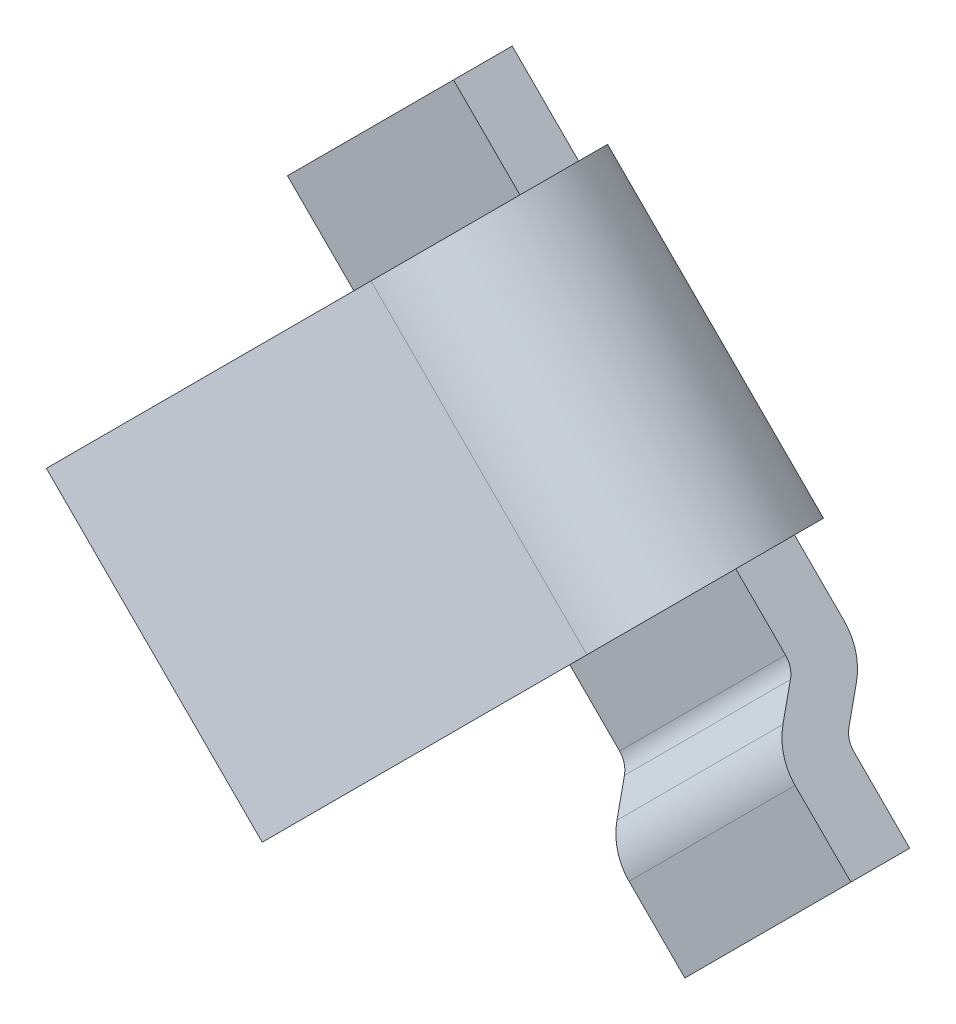
ISO-10303-21;
HEADER;
FILE_DESCRIPTION(('STEP AP214'),'2;1');
FILE_NAME('part.step','',(''),(''),'','','');
FILE_SCHEMA(('AUTOMOTIVE_DESIGN { 1 0 10303 214 1 1 1 1 }'));
ENDSEC;
DATA;
#1=APPLICATION_CONTEXT('core data for automotive mechanical design processes');
#2=APPLICATION_PROTOCOL_DEFINITION('international standard','automotive_design',2000,#1);
#3=PRODUCT_CONTEXT('',#1,'mechanical');
#4=PRODUCT('Part','Part','',(#3));
#5=PRODUCT_RELATED_PRODUCT_CATEGORY('part','',(#4));
#6=PRODUCT_DEFINITION_FORMATION('','',#4);
#7=PRODUCT_DEFINITION_CONTEXT('part definition',#1,'design');
#8=PRODUCT_DEFINITION('design','',#6,#7);
#9=PRODUCT_DEFINITION_SHAPE('','',#8);
#10=(LENGTH_UNIT() NAMED_UNIT(*) SI_UNIT(.MILLI.,.METRE.));
#11=(NAMED_UNIT(*) PLANE_ANGLE_UNIT() SI_UNIT($,.RADIAN.));
#12=(NAMED_UNIT(*) SI_UNIT($,.STERADIAN.) SOLID_ANGLE_UNIT());
#13=UNCERTAINTY_MEASURE_WITH_UNIT(LENGTH_MEASURE(1.E-05),#10,'distance_accuracy_value','');
#14=(GEOMETRIC_REPRESENTATION_CONTEXT(3) GLOBAL_UNCERTAINTY_ASSIGNED_CONTEXT((#13)) GLOBAL_UNIT_ASSIGNED_CONTEXT((#10,
#11,#12)) REPRESENTATION_CONTEXT('',''));
#15=CARTESIAN_POINT('',(0.,0.,0.));
#16=DIRECTION('',(0.,0.,1.));
#17=DIRECTION('',(1.,0.,0.));
#18=AXIS2_PLACEMENT_3D('',#15,#16,#17);
#19=CARTESIAN_POINT('',(-6.318290848747,5.687890899191,1.387873023133));
#20=DIRECTION('',(-0.298836238729927,-0.298836238729927,-0.906307787036777));
#21=DIRECTION('',(-0.949705125315019,0.,0.313145613014751));
#22=AXIS2_PLACEMENT_3D('',#19,#20,#21);
#23=PLANE('',#22);
#24=DIRECTION('',(-0.640856382055835,-0.640856382055835,0.422618261740559));
#25=VECTOR('',#24,1.);
#26=CARTESIAN_POINT('',(-5.485177552074,6.521004195864,0.83846928287));
#27=LINE('',#26,#25);
#28=CARTESIAN_POINT('',(-5.48517755207425,6.52100419586376,0.838469282870097));
#29=VERTEX_POINT('',#28);
#30=CARTESIAN_POINT('',(-6.31829084874694,5.68789089919106,1.38787302313318));
#31=VERTEX_POINT('',#30);
#32=EDGE_CURVE('E145',#29,#31,#27,.T.);
#33=ORIENTED_EDGE('',*,*,#32,.T.);
#34=DIRECTION('',(0.707106781186547,-0.707106781186547,0.));
#35=VECTOR('',#34,1.);
#36=CARTESIAN_POINT('',(-5.39905203320441,4.76865208364859,1.38787302313327));
#37=LINE('',#36,#35);
#38=CARTESIAN_POINT('',(-5.39905203320414,4.76865208364886,1.38787302313309));
#39=VERTEX_POINT('',#38);
#40=EDGE_CURVE('E164',#39,#31,#37,.F.);
#41=ORIENTED_EDGE('',*,*,#40,.F.);
#42=DIRECTION('',(0.640856382055698,0.640856382055698,-0.422618261740976));
#43=VECTOR('',#42,1.);
#44=CARTESIAN_POINT('',(-5.399052033204,4.768652083649,1.387873023133));
#45=LINE('',#44,#43);
#46=CARTESIAN_POINT('',(-4.56593873653171,5.60176538032129,0.838469282869908));
#47=VERTEX_POINT('',#46);
#48=EDGE_CURVE('E148',#39,#47,#45,.T.);
#49=ORIENTED_EDGE('',*,*,#48,.T.);
#50=DIRECTION('',(0.707106781186548,-0.707106781186548,0.));
#51=VECTOR('',#50,1.);
#52=CARTESIAN_POINT('',(-4.65929770991604,5.69512435370597,0.838469282869894));
#53=LINE('',#52,#51);
#54=EDGE_CURVE('E142',#29,#47,#53,.T.);
#55=ORIENTED_EDGE('',*,*,#54,.F.);
#56=EDGE_LOOP('',(#33,#41,#49,#55));
#57=FACE_BOUND('',#56,.T.);
#58=ADVANCED_FACE('F17',(#57),#23,.F.);
#59=CARTESIAN_POINT('',(-4.823657641218,5.530764422404,0.34));
#60=DIRECTION('',(0.707106781186548,-0.707106781186548,0.));
#61=DIRECTION('',(0.707106781186548,0.707106781186548,0.));
#62=AXIS2_PLACEMENT_3D('',#59,#60,#61);
#63=CYLINDRICAL_SURFACE('',#62,0.55);
#64=CARTESIAN_POINT('',(-4.7302986678335,5.4374054490195,0.34));
#65=DIRECTION('',(0.707106781186548,-0.707106781186548,0.));
#66=DIRECTION('',(0.707106781186548,0.707106781186548,0.));
#67=AXIS2_PLACEMENT_3D('',#64,#65,#66);
#68=CIRCLE('',#67,0.55);
#69=CARTESIAN_POINT('',(-4.730298667833,5.43740544902,-0.21));
#70=VERTEX_POINT('',#69);
#71=EDGE_CURVE('E219',#47,#70,#68,.F.);
#72=ORIENTED_EDGE('',*,*,#71,.T.);
#73=DIRECTION('',(0.707106781186933,-0.707106781186163,0.));
#74=VECTOR('',#73,1.);
#75=CARTESIAN_POINT('',(-5.649537483376,6.356644264562,-0.21));
#76=LINE('',#75,#74);
#77=CARTESIAN_POINT('',(-5.649537483376,6.356644264562,-0.21));
#78=VERTEX_POINT('',#77);
#79=EDGE_CURVE('E156',#78,#70,#76,.T.);
#80=ORIENTED_EDGE('',*,*,#79,.F.);
#81=CARTESIAN_POINT('',(-5.649537483376,6.356644264562,0.34));
#82=DIRECTION('',(0.707106781186548,-0.707106781186548,0.));
#83=DIRECTION('',(0.707106781186548,0.707106781186548,0.));
#84=AXIS2_PLACEMENT_3D('',#81,#82,#83);
#85=CIRCLE('',#84,0.55);
#86=EDGE_CURVE('E20',#78,#29,#85,.T.);
#87=ORIENTED_EDGE('',*,*,#86,.T.);
#88=ORIENTED_EDGE('',*,*,#54,.T.);
#89=EDGE_LOOP('',(#72,#80,#87,#88));
#90=FACE_BOUND('',#89,.T.);
#91=ADVANCED_FACE('F154',(#90),#63,.T.);
#92=CARTESIAN_POINT('',(-5.485177552074,6.521004195864,0.83846928287));
#93=DIRECTION('',(0.707106781186548,-0.707106781186548,0.));
#94=DIRECTION('',(0.707106781186548,0.707106781186548,0.));
#95=AXIS2_PLACEMENT_3D('',#92,#93,#94);
#96=PLANE('',#95);
#97=DIRECTION('',(-0.640856382055879,-0.640856382055878,0.422618261740426));
#98=VECTOR('',#97,1.);
#99=CARTESIAN_POINT('',(-5.55988661175685,6.44629513618115,0.611892336111443));
#100=LINE('',#99,#98);
#101=CARTESIAN_POINT('',(-5.55988661175694,6.44629513618106,0.611892336111238));
#102=VERTEX_POINT('',#101);
#103=CARTESIAN_POINT('',(-6.39299990842923,5.61318183950877,1.16129607637382));
#104=VERTEX_POINT('',#103);
#105=EDGE_CURVE('E253',#102,#104,#100,.T.);
#106=ORIENTED_EDGE('',*,*,#105,.T.);
#107=DIRECTION('',(0.298836238730213,0.298836238730213,0.906307787036588));
#108=VECTOR('',#107,1.);
#109=CARTESIAN_POINT('',(-6.3929999084295,5.6131818395085,1.161296076374));
#110=LINE('',#109,#108);
#111=EDGE_CURVE('E160',#31,#104,#110,.F.);
#112=ORIENTED_EDGE('',*,*,#111,.F.);
#113=ORIENTED_EDGE('',*,*,#32,.F.);
#114=ORIENTED_EDGE('',*,*,#86,.F.);
#115=DIRECTION('',(0.,0.,1.));
#116=VECTOR('',#115,1.);
#117=CARTESIAN_POINT('',(-5.649537483376,6.356644264562,0.83846928287));
#118=LINE('',#117,#116);
#119=CARTESIAN_POINT('',(-5.649537483376,6.356644264562,0.0399999999999997));
#120=VERTEX_POINT('',#119);
#121=EDGE_CURVE('E137',#120,#78,#118,.F.);
#122=ORIENTED_EDGE('',*,*,#121,.F.);
#123=CARTESIAN_POINT('',(-5.649537483376,6.356644264562,0.34));
#124=DIRECTION('',(0.707106781186548,-0.707106781186548,0.));
#125=DIRECTION('',(0.707106781186548,0.707106781186548,0.));
#126=AXIS2_PLACEMENT_3D('',#123,#124,#125);
#127=CIRCLE('',#126,0.3);
#128=EDGE_CURVE('E162',#102,#120,#127,.F.);
#129=ORIENTED_EDGE('',*,*,#128,.F.);
#130=EDGE_LOOP('',(#106,#112,#113,#114,#122,#129));
#131=FACE_BOUND('',#130,.T.);
#132=ADVANCED_FACE('F158',(#131),#96,.F.);
#133=CARTESIAN_POINT('',(-5.473761092887,4.693943023966,1.161296076374));
#134=DIRECTION('',(-0.640856382055745,-0.640856382055745,0.422618261740832));
#135=DIRECTION('',(0.707106781186547,-0.707106781186547,0.));
#136=AXIS2_PLACEMENT_3D('',#133,#134,#135);
#137=PLANE('',#136);
#138=ORIENTED_EDGE('',*,*,#40,.T.);
#139=ORIENTED_EDGE('',*,*,#111,.T.);
#140=DIRECTION('',(0.707106781186231,-0.707106781186863,2.08333617451448E-13));
#141=VECTOR('',#140,1.);
#142=CARTESIAN_POINT('',(-6.39299990842909,5.61318183950891,1.16129607637373));
#143=LINE('',#142,#141);
#144=CARTESIAN_POINT('',(-5.473761092887,4.693943023966,1.161296076374));
#145=VERTEX_POINT('',#144);
#146=EDGE_CURVE('E247',#104,#145,#143,.T.);
#147=ORIENTED_EDGE('',*,*,#146,.T.);
#148=DIRECTION('',(0.29883623873184,0.29883623873184,0.906307787035516));
#149=VECTOR('',#148,1.);
#150=CARTESIAN_POINT('',(-5.473761092887,4.693943023966,1.161296076374));
#151=LINE('',#150,#149);
#152=EDGE_CURVE('E222',#145,#39,#151,.T.);
#153=ORIENTED_EDGE('',*,*,#152,.T.);
#154=EDGE_LOOP('',(#138,#139,#147,#153));
#155=FACE_BOUND('',#154,.T.);
#156=ADVANCED_FACE('F483',(#155),#137,.T.);
#157=CARTESIAN_POINT('',(-4.640647796214,5.527056320639,0.611892336111));
#158=DIRECTION('',(-0.707106781186548,0.707106781186548,0.));
#159=DIRECTION('',(-0.707106781186548,-0.707106781186548,0.));
#160=AXIS2_PLACEMENT_3D('',#157,#158,#159);
#161=PLANE('',#160);
#162=ORIENTED_EDGE('',*,*,#48,.F.);
#163=ORIENTED_EDGE('',*,*,#152,.F.);
#164=DIRECTION('',(0.640856382055879,0.640856382055879,-0.422618261740426));
#165=VECTOR('',#164,1.);
#166=CARTESIAN_POINT('',(-5.473761092887,4.693943023966,1.161296076374));
#167=LINE('',#166,#165);
#168=CARTESIAN_POINT('',(-4.64064779621444,5.52705632063856,0.611892336111238));
#169=VERTEX_POINT('',#168);
#170=EDGE_CURVE('E218',#145,#169,#167,.T.);
#171=ORIENTED_EDGE('',*,*,#170,.T.);
#172=CARTESIAN_POINT('',(-4.7302986678335,5.4374054490195,0.34));
#173=DIRECTION('',(0.707106781186548,-0.707106781186548,0.));
#174=DIRECTION('',(0.707106781186548,0.707106781186548,0.));
#175=AXIS2_PLACEMENT_3D('',#172,#173,#174);
#176=CIRCLE('',#175,0.3);
#177=CARTESIAN_POINT('',(-4.730298667833,5.43740544902,0.04));
#178=VERTEX_POINT('',#177);
#179=EDGE_CURVE('E221',#178,#169,#176,.T.);
#180=ORIENTED_EDGE('',*,*,#179,.F.);
#181=DIRECTION('',(0.,0.,1.));
#182=VECTOR('',#181,1.);
#183=CARTESIAN_POINT('',(-4.730298667833,5.43740544902,0.611892336111));
#184=LINE('',#183,#182);
#185=EDGE_CURVE('E223',#70,#178,#184,.T.);
#186=ORIENTED_EDGE('',*,*,#185,.F.);
#187=ORIENTED_EDGE('',*,*,#71,.F.);
#188=EDGE_LOOP('',(#162,#163,#171,#180,#186,#187));
#189=FACE_BOUND('',#188,.T.);
#190=ADVANCED_FACE('F474',(#189),#161,.F.);
#191=CARTESIAN_POINT('',(-5.93238019585,6.639486977037,-0.21));
#192=DIRECTION('',(0.,0.,-1.));
#193=DIRECTION('',(-1.,0.,0.));
#194=AXIS2_PLACEMENT_3D('',#191,#192,#193);
#195=PLANE('',#194);
#196=DIRECTION('',(0.707106781186548,-0.707106781186548,0.));
#197=VECTOR('',#196,1.);
#198=CARTESIAN_POINT('',(-4.730298667833,5.43740544902,-0.21));
#199=LINE('',#198,#197);
#200=CARTESIAN_POINT('',(-4.518166633477,5.225273414664,-0.21));
#201=VERTEX_POINT('',#200);
#202=EDGE_CURVE('E172',#70,#201,#199,.T.);
#203=ORIENTED_EDGE('',*,*,#202,.T.);
#204=DIRECTION('',(0.707106781186548,0.707106781186548,0.));
#205=VECTOR('',#204,1.);
#206=CARTESIAN_POINT('',(-4.518166633477,5.225273414664,-0.21));
#207=LINE('',#206,#205);
#208=CARTESIAN_POINT('',(-5.225273414664,4.518166633477,-0.21));
#209=VERTEX_POINT('',#208);
#210=EDGE_CURVE('E288',#209,#201,#207,.T.);
#211=ORIENTED_EDGE('',*,*,#210,.F.);
#212=DIRECTION('',(-0.707106781186548,0.707106781186548,0.));
#213=VECTOR('',#212,1.);
#214=CARTESIAN_POINT('',(-3.207106781187,2.5,-0.21));
#215=LINE('',#214,#213);
#216=CARTESIAN_POINT('',(-6.639486977037,5.93238019585,-0.21));
#217=VERTEX_POINT('',#216);
#218=EDGE_CURVE('E213',#209,#217,#215,.T.);
#219=ORIENTED_EDGE('',*,*,#218,.T.);
#220=DIRECTION('',(0.707106781186548,0.707106781186548,0.));
#221=VECTOR('',#220,1.);
#222=CARTESIAN_POINT('',(-6.639486977037,5.93238019585,-0.21));
#223=LINE('',#222,#221);
#224=CARTESIAN_POINT('',(-5.93238019585,6.639486977037,-0.21));
#225=VERTEX_POINT('',#224);
#226=EDGE_CURVE('E178',#217,#225,#223,.T.);
#227=ORIENTED_EDGE('',*,*,#226,.T.);
#228=DIRECTION('',(0.707106781185296,-0.707106781187799,0.));
#229=VECTOR('',#228,1.);
#230=CARTESIAN_POINT('',(-5.93238019585,6.639486977037,-0.21));
#231=LINE('',#230,#229);
#232=EDGE_CURVE('E176',#225,#78,#231,.T.);
#233=ORIENTED_EDGE('',*,*,#232,.T.);
#234=ORIENTED_EDGE('',*,*,#79,.T.);
#235=EDGE_LOOP('',(#203,#211,#219,#227,#233,#234));
#236=FACE_BOUND('',#235,.T.);
#237=ADVANCED_FACE('F305',(#236),#195,.T.);
#238=CARTESIAN_POINT('',(-4.267766952966,4.974873734153,0.));
#239=DIRECTION('',(0.707106781186548,0.707106781186548,0.));
#240=DIRECTION('',(-0.707106781186548,0.707106781186548,0.));
#241=AXIS2_PLACEMENT_3D('',#238,#239,#240);
#242=CYLINDRICAL_SURFACE('',#241,0.25);
#243=CARTESIAN_POINT('',(-4.267766952966,4.974873734153,0.));
#244=DIRECTION('',(0.707106781186548,0.707106781186548,0.));
#245=DIRECTION('',(-0.707106781186548,0.707106781186548,0.));
#246=AXIS2_PLACEMENT_3D('',#243,#244,#245);
#247=CIRCLE('',#246,0.25);
#248=CARTESIAN_POINT('',(-4.267766952966,4.974873734153,0.25));
#249=VERTEX_POINT('',#248);
#250=CARTESIAN_POINT('',(-4.39326806636934,5.10037484755634,0.17606516142923));
#251=VERTEX_POINT('',#250);
#252=EDGE_CURVE('E201',#249,#251,#247,.F.);
#253=ORIENTED_EDGE('',*,*,#252,.T.);
#254=DIRECTION('',(0.707106781186547,0.707106781186547,0.));
#255=VECTOR('',#254,1.);
#256=CARTESIAN_POINT('',(-5.100374847556,4.39326806637,0.176065161429));
#257=LINE('',#256,#255);
#258=CARTESIAN_POINT('',(-5.10037484755609,4.39326806636959,0.17606516142923));
#259=VERTEX_POINT('',#258);
#260=EDGE_CURVE('E174',#259,#251,#257,.T.);
#261=ORIENTED_EDGE('',*,*,#260,.F.);
#262=CARTESIAN_POINT('',(-4.9748737341525,4.2677669529665,0.));
#263=DIRECTION('',(0.707106781186548,0.707106781186548,0.));
#264=DIRECTION('',(-0.707106781186548,0.707106781186548,0.));
#265=AXIS2_PLACEMENT_3D('',#262,#263,#264);
#266=CIRCLE('',#265,0.25);
#267=CARTESIAN_POINT('',(-4.97487373415275,4.26776695296625,0.25));
#268=VERTEX_POINT('',#267);
#269=EDGE_CURVE('E206',#259,#268,#266,.T.);
#270=ORIENTED_EDGE('',*,*,#269,.T.);
#271=DIRECTION('',(-0.707106781186547,-0.707106781186547,0.));
#272=VECTOR('',#271,1.);
#273=CARTESIAN_POINT('',(-4.267766952966,4.974873734153,0.25));
#274=LINE('',#273,#272);
#275=EDGE_CURVE('E257',#249,#268,#274,.T.);
#276=ORIENTED_EDGE('',*,*,#275,.F.);
#277=EDGE_LOOP('',(#253,#261,#270,#276));
#278=FACE_BOUND('',#277,.T.);
#279=ADVANCED_FACE('F455',(#278),#242,.T.);
#280=CARTESIAN_POINT('',(-4.39326806637,5.100374847556,0.176065161429));
#281=DIRECTION('',(-0.502004453613279,0.502004453613279,0.704260645716391));
#282=DIRECTION('',(0.,-0.814301211537265,0.580442535389113));
#283=AXIS2_PLACEMENT_3D('',#280,#281,#282);
#284=PLANE('',#283);
#285=DIRECTION('',(-0.497987478309676,0.497987478309676,-0.709941506670473));
#286=VECTOR('',#285,1.);
#287=CARTESIAN_POINT('',(-4.3932680663695,5.1003748475565,0.176065161429));
#288=LINE('',#287,#286);
#289=CARTESIAN_POINT('',(-4.46796618811588,5.17507296930288,0.0695739354283041));
#290=VERTEX_POINT('',#289);
#291=EDGE_CURVE('E200',#251,#290,#288,.T.);
#292=ORIENTED_EDGE('',*,*,#291,.T.);
#293=DIRECTION('',(0.707106781186548,0.707106781186548,0.));
#294=VECTOR('',#293,1.);
#295=CARTESIAN_POINT('',(-4.46796618811583,5.17507296930284,0.0695739354281286));
#296=LINE('',#295,#294);
#297=CARTESIAN_POINT('',(-5.17507296930288,4.46796618811588,0.0695739354283041));
#298=VERTEX_POINT('',#297);
#299=EDGE_CURVE('E205',#290,#298,#296,.F.);
#300=ORIENTED_EDGE('',*,*,#299,.T.);
#301=DIRECTION('',(0.497987478309676,-0.497987478309676,0.709941506670473));
#302=VECTOR('',#301,1.);
#303=CARTESIAN_POINT('',(-5.175072969303,4.467966188116,0.0695739354283599));
#304=LINE('',#303,#302);
#305=EDGE_CURVE('E209',#298,#259,#304,.T.);
#306=ORIENTED_EDGE('',*,*,#305,.T.);
#307=ORIENTED_EDGE('',*,*,#260,.T.);
#308=EDGE_LOOP('',(#292,#300,#306,#307));
#309=FACE_BOUND('',#308,.T.);
#310=ADVANCED_FACE('F445',(#309),#284,.T.);
#311=CARTESIAN_POINT('',(-4.518166633477,5.225273414664,0.04));
#312=DIRECTION('',(0.707106781186548,0.707106781186548,0.));
#313=DIRECTION('',(-0.707106781186548,0.707106781186548,0.));
#314=AXIS2_PLACEMENT_3D('',#311,#312,#313);
#315=CYLINDRICAL_SURFACE('',#314,0.25);
#316=CARTESIAN_POINT('',(-4.518166633477,5.225273414664,0.04));
#317=DIRECTION('',(0.707106781186548,0.707106781186548,0.));
#318=DIRECTION('',(-0.707106781186548,0.707106781186548,0.));
#319=AXIS2_PLACEMENT_3D('',#316,#317,#318);
#320=CIRCLE('',#319,0.25);
#321=CARTESIAN_POINT('',(-4.39266552007404,5.09977230126104,-0.136065161429053));
#322=VERTEX_POINT('',#321);
#323=EDGE_CURVE('E196',#201,#322,#320,.F.);
#324=ORIENTED_EDGE('',*,*,#323,.T.);
#325=DIRECTION('',(0.707106781186548,0.707106781186548,0.));
#326=VECTOR('',#325,1.);
#327=CARTESIAN_POINT('',(-5.099772301261,4.392665520074,-0.136065161429));
#328=LINE('',#327,#326);
#329=CARTESIAN_POINT('',(-5.09977230126104,4.39266552007404,-0.136065161429053));
#330=VERTEX_POINT('',#329);
#331=EDGE_CURVE('E285',#330,#322,#328,.T.);
#332=ORIENTED_EDGE('',*,*,#331,.F.);
#333=CARTESIAN_POINT('',(-5.225273414664,4.518166633477,0.04));
#334=DIRECTION('',(0.707106781186548,0.707106781186548,0.));
#335=DIRECTION('',(-0.707106781186548,0.707106781186548,0.));
#336=AXIS2_PLACEMENT_3D('',#333,#334,#335);
#337=CIRCLE('',#336,0.25);
#338=EDGE_CURVE('E210',#330,#209,#337,.T.);
#339=ORIENTED_EDGE('',*,*,#338,.T.);
#340=ORIENTED_EDGE('',*,*,#210,.T.);
#341=EDGE_LOOP('',(#324,#332,#339,#340));
#342=FACE_BOUND('',#341,.T.);
#343=ADVANCED_FACE('F435',(#342),#315,.T.);
#344=CARTESIAN_POINT('',(-4.392665520074,5.099772301261,-0.136065161429));
#345=DIRECTION('',(0.502004453613279,-0.502004453613279,-0.704260645716391));
#346=DIRECTION('',(-0.814301211537265,0.,-0.580442535389113));
#347=AXIS2_PLACEMENT_3D('',#344,#345,#346);
#348=PLANE('',#347);
#349=DIRECTION('',(0.497987478309675,-0.497987478309675,0.709941506670473));
#350=VECTOR('',#349,1.);
#351=CARTESIAN_POINT('',(-4.392665520074,5.099772301261,-0.136065161429));
#352=LINE('',#351,#350);
#353=CARTESIAN_POINT('',(-4.31796739832737,5.02507417951437,-0.029573935428304));
#354=VERTEX_POINT('',#353);
#355=EDGE_CURVE('E195',#322,#354,#352,.T.);
#356=ORIENTED_EDGE('',*,*,#355,.T.);
#357=DIRECTION('',(0.707106781186548,0.707106781186548,0.));
#358=VECTOR('',#357,1.);
#359=CARTESIAN_POINT('',(-4.31796739832741,5.02507417951441,-0.0295739354284825));
#360=LINE('',#359,#358);
#361=CARTESIAN_POINT('',(-5.02507417951415,4.31796739832765,-0.0295739354282736));
#362=VERTEX_POINT('',#361);
#363=EDGE_CURVE('E283',#354,#362,#360,.F.);
#364=ORIENTED_EDGE('',*,*,#363,.T.);
#365=DIRECTION('',(-0.497987478309675,0.497987478309675,-0.709941506670473));
#366=VECTOR('',#365,1.);
#367=CARTESIAN_POINT('',(-5.0250741795145,4.3179673983275,-0.0295739354283601));
#368=LINE('',#367,#366);
#369=EDGE_CURVE('E214',#362,#330,#368,.T.);
#370=ORIENTED_EDGE('',*,*,#369,.T.);
#371=ORIENTED_EDGE('',*,*,#331,.T.);
#372=EDGE_LOOP('',(#356,#364,#370,#371));
#373=FACE_BOUND('',#372,.T.);
#374=ADVANCED_FACE('F425',(#373),#348,.T.);
#375=CARTESIAN_POINT('',(-4.267766952966,4.974873734153,-0.1));
#376=DIRECTION('',(0.707106781186548,0.707106781186548,0.));
#377=DIRECTION('',(-0.707106781186548,0.707106781186548,0.));
#378=AXIS2_PLACEMENT_3D('',#375,#376,#377);
#379=CYLINDRICAL_SURFACE('',#378,0.1);
#380=ORIENTED_EDGE('',*,*,#363,.F.);
#381=CARTESIAN_POINT('',(-4.267766952966,4.974873734153,-0.1));
#382=DIRECTION('',(0.707106781186548,0.707106781186548,0.));
#383=DIRECTION('',(-0.707106781186548,0.707106781186548,0.));
#384=AXIS2_PLACEMENT_3D('',#381,#382,#383);
#385=CIRCLE('',#384,0.1);
#386=CARTESIAN_POINT('',(-4.267766952966,4.974873734153,0.));
#387=VERTEX_POINT('',#386);
#388=EDGE_CURVE('E192',#354,#387,#385,.T.);
#389=ORIENTED_EDGE('',*,*,#388,.T.);
#390=DIRECTION('',(-0.707106781186547,-0.707106781186547,0.));
#391=VECTOR('',#390,1.);
#392=CARTESIAN_POINT('',(-4.267766952966,4.974873734153,0.));
#393=LINE('',#392,#391);
#394=CARTESIAN_POINT('',(-4.97487373415275,4.26776695296625,0.));
#395=VERTEX_POINT('',#394);
#396=EDGE_CURVE('E279',#387,#395,#393,.T.);
#397=ORIENTED_EDGE('',*,*,#396,.T.);
#398=CARTESIAN_POINT('',(-4.9748737341525,4.2677669529665,-0.1));
#399=DIRECTION('',(0.707106781186548,0.707106781186548,0.));
#400=DIRECTION('',(-0.707106781186548,0.707106781186548,0.));
#401=AXIS2_PLACEMENT_3D('',#398,#399,#400);
#402=CIRCLE('',#401,0.1);
#403=EDGE_CURVE('E215',#395,#362,#402,.F.);
#404=ORIENTED_EDGE('',*,*,#403,.T.);
#405=EDGE_LOOP('',(#380,#389,#397,#404));
#406=FACE_BOUND('',#405,.T.);
#407=ADVANCED_FACE('F415',(#406),#379,.F.);
#408=CARTESIAN_POINT('',(0.,-0.707106781187,0.));
#409=DIRECTION('',(0.,0.,1.));
#410=DIRECTION('',(1.,0.,0.));
#411=AXIS2_PLACEMENT_3D('',#408,#409,#410);
#412=PLANE('',#411);
#413=DIRECTION('',(-0.707106781186548,-0.707106781186548,0.));
#414=VECTOR('',#413,1.);
#415=CARTESIAN_POINT('',(8.959539360508,17.726622683213,0.));
#416=LINE('',#415,#414);
#417=CARTESIAN_POINT('',(-4.029988270759,4.737095051946,0.));
#418=VERTEX_POINT('',#417);
#419=CARTESIAN_POINT('',(-4.737095051946,4.029988270759,0.));
#420=VERTEX_POINT('',#419);
#421=EDGE_CURVE('E267',#418,#420,#416,.T.);
#422=ORIENTED_EDGE('',*,*,#421,.T.);
#423=DIRECTION('',(-0.707106781186548,0.707106781186548,0.));
#424=VECTOR('',#423,1.);
#425=CARTESIAN_POINT('',(-3.207106781187,2.5,0.));
#426=LINE('',#425,#424);
#427=EDGE_CURVE('E292',#420,#395,#426,.T.);
#428=ORIENTED_EDGE('',*,*,#427,.T.);
#429=ORIENTED_EDGE('',*,*,#396,.F.);
#430=DIRECTION('',(0.707106781186548,-0.707106781186548,0.));
#431=VECTOR('',#430,1.);
#432=CARTESIAN_POINT('',(-4.267766952966,4.974873734153,0.));
#433=LINE('',#432,#431);
#434=EDGE_CURVE('E194',#387,#418,#433,.T.);
#435=ORIENTED_EDGE('',*,*,#434,.T.);
#436=EDGE_LOOP('',(#422,#428,#429,#435));
#437=FACE_BOUND('',#436,.T.);
#438=ADVANCED_FACE('F405',(#437),#412,.F.);
#439=CARTESIAN_POINT('',(8.959539360508,17.726622683213,1.5));
#440=DIRECTION('',(-0.707106781186548,0.707106781186548,0.));
#441=DIRECTION('',(-0.707106781186548,-0.707106781186548,0.));
#442=AXIS2_PLACEMENT_3D('',#439,#440,#441);
#443=PLANE('',#442);
#444=DIRECTION('',(0.,0.,1.));
#445=VECTOR('',#444,1.);
#446=CARTESIAN_POINT('',(-4.737095051946,4.029988270759,0.25));
#447=LINE('',#446,#445);
#448=CARTESIAN_POINT('',(-4.737095051946,4.029988270759,0.25));
#449=VERTEX_POINT('',#448);
#450=EDGE_CURVE('E295',#449,#420,#447,.F.);
#451=ORIENTED_EDGE('',*,*,#450,.T.);
#452=ORIENTED_EDGE('',*,*,#421,.F.);
#453=DIRECTION('',(0.,0.,1.));
#454=VECTOR('',#453,1.);
#455=CARTESIAN_POINT('',(-4.029988270759,4.737095051946,0.25));
#456=LINE('',#455,#454);
#457=CARTESIAN_POINT('',(-4.029988270759,4.737095051946,0.25));
#458=VERTEX_POINT('',#457);
#459=EDGE_CURVE('E274',#418,#458,#456,.T.);
#460=ORIENTED_EDGE('',*,*,#459,.T.);
#461=DIRECTION('',(0.707106781186548,0.707106781186547,0.));
#462=VECTOR('',#461,1.);
#463=CARTESIAN_POINT('',(-4.737095051946,4.029988270759,0.25));
#464=LINE('',#463,#462);
#465=EDGE_CURVE('E260',#449,#458,#464,.T.);
#466=ORIENTED_EDGE('',*,*,#465,.F.);
#467=EDGE_LOOP('',(#451,#452,#460,#466));
#468=FACE_BOUND('',#467,.T.);
#469=ADVANCED_FACE('F396',(#468),#443,.F.);
#470=CARTESIAN_POINT('',(0.,-0.707106781187,0.25));
#471=DIRECTION('',(0.,0.,1.));
#472=DIRECTION('',(1.,0.,0.));
#473=AXIS2_PLACEMENT_3D('',#470,#471,#472);
#474=PLANE('',#473);
#475=ORIENTED_EDGE('',*,*,#275,.T.);
#476=DIRECTION('',(-0.707106781186548,0.707106781186548,0.));
#477=VECTOR('',#476,1.);
#478=CARTESIAN_POINT('',(-3.207106781187,2.5,0.25));
#479=LINE('',#478,#477);
#480=EDGE_CURVE('E208',#268,#449,#479,.F.);
#481=ORIENTED_EDGE('',*,*,#480,.T.);
#482=ORIENTED_EDGE('',*,*,#465,.T.);
#483=DIRECTION('',(0.707106781186548,-0.707106781186548,0.));
#484=VECTOR('',#483,1.);
#485=CARTESIAN_POINT('',(-4.267766952966,4.974873734153,0.25));
#486=LINE('',#485,#484);
#487=EDGE_CURVE('E245',#458,#249,#486,.F.);
#488=ORIENTED_EDGE('',*,*,#487,.T.);
#489=EDGE_LOOP('',(#475,#481,#482,#488));
#490=FACE_BOUND('',#489,.T.);
#491=ADVANCED_FACE('F387',(#490),#474,.T.);
#492=CARTESIAN_POINT('',(-5.473761092887,4.693943023966,1.161296076374));
#493=DIRECTION('',(0.298836238729927,0.298836238729927,0.906307787036777));
#494=DIRECTION('',(0.949705125315019,0.,-0.313145613014751));
#495=AXIS2_PLACEMENT_3D('',#492,#493,#494);
#496=PLANE('',#495);
#497=ORIENTED_EDGE('',*,*,#170,.F.);
#498=ORIENTED_EDGE('',*,*,#146,.F.);
#499=ORIENTED_EDGE('',*,*,#105,.F.);
#500=DIRECTION('',(0.707106781186548,-0.707106781186548,0.));
#501=VECTOR('',#500,1.);
#502=CARTESIAN_POINT('',(-4.734006769599,5.62041529402301,0.611892336111015));
#503=LINE('',#502,#501);
#504=EDGE_CURVE('E242',#102,#169,#503,.T.);
#505=ORIENTED_EDGE('',*,*,#504,.T.);
#506=EDGE_LOOP('',(#497,#498,#499,#505));
#507=FACE_BOUND('',#506,.T.);
#508=ADVANCED_FACE('F319',(#507),#496,.F.);
#509=CARTESIAN_POINT('',(-3.207106781187,2.5,0.25));
#510=DIRECTION('',(0.707106781186548,0.707106781186548,0.));
#511=DIRECTION('',(-0.707106781186548,0.707106781186548,0.));
#512=AXIS2_PLACEMENT_3D('',#509,#510,#511);
#513=PLANE('',#512);
#514=ORIENTED_EDGE('',*,*,#450,.F.);
#515=ORIENTED_EDGE('',*,*,#480,.F.);
#516=ORIENTED_EDGE('',*,*,#269,.F.);
#517=ORIENTED_EDGE('',*,*,#305,.F.);
#518=CARTESIAN_POINT('',(-5.225273414664,4.518166633477,0.14));
#519=DIRECTION('',(0.707106781186548,0.707106781186548,0.));
#520=DIRECTION('',(-0.707106781186548,0.707106781186548,0.));
#521=AXIS2_PLACEMENT_3D('',#518,#519,#520);
#522=CIRCLE('',#521,0.1);
#523=CARTESIAN_POINT('',(-5.225273414664,4.518166633477,0.04));
#524=VERTEX_POINT('',#523);
#525=EDGE_CURVE('E203',#298,#524,#522,.T.);
#526=ORIENTED_EDGE('',*,*,#525,.T.);
#527=DIRECTION('',(0.707106781186548,-0.707106781186548,0.));
#528=VECTOR('',#527,1.);
#529=CARTESIAN_POINT('',(-6.639486977037,5.93238019585,0.0399999999999998));
#530=LINE('',#529,#528);
#531=CARTESIAN_POINT('',(-6.639486977037,5.93238019585,0.0399999999999998));
#532=VERTEX_POINT('',#531);
#533=EDGE_CURVE('E182',#532,#524,#530,.T.);
#534=ORIENTED_EDGE('',*,*,#533,.F.);
#535=DIRECTION('',(0.,0.,1.));
#536=VECTOR('',#535,1.);
#537=CARTESIAN_POINT('',(-6.639486977037,5.93238019585,0.04));
#538=LINE('',#537,#536);
#539=EDGE_CURVE('E183',#217,#532,#538,.T.);
#540=ORIENTED_EDGE('',*,*,#539,.F.);
#541=ORIENTED_EDGE('',*,*,#218,.F.);
#542=ORIENTED_EDGE('',*,*,#338,.F.);
#543=ORIENTED_EDGE('',*,*,#369,.F.);
#544=ORIENTED_EDGE('',*,*,#403,.F.);
#545=ORIENTED_EDGE('',*,*,#427,.F.);
#546=EDGE_LOOP('',(#514,#515,#516,#517,#526,#534,#540,#541,#542,#543,#544,#545));
#547=FACE_BOUND('',#546,.T.);
#548=ADVANCED_FACE('F368',(#547),#513,.F.);
#549=CARTESIAN_POINT('',(-4.518166633477,5.225273414664,0.14));
#550=DIRECTION('',(0.707106781186548,0.707106781186548,0.));
#551=DIRECTION('',(-0.707106781186548,0.707106781186548,0.));
#552=AXIS2_PLACEMENT_3D('',#549,#550,#551);
#553=CYLINDRICAL_SURFACE('',#552,0.1);
#554=ORIENTED_EDGE('',*,*,#299,.F.);
#555=CARTESIAN_POINT('',(-4.518166633477,5.225273414664,0.14));
#556=DIRECTION('',(0.707106781186548,0.707106781186548,0.));
#557=DIRECTION('',(-0.707106781186548,0.707106781186548,0.));
#558=AXIS2_PLACEMENT_3D('',#555,#556,#557);
#559=CIRCLE('',#558,0.1);
#560=CARTESIAN_POINT('',(-4.518166633477,5.225273414664,0.04));
#561=VERTEX_POINT('',#560);
#562=EDGE_CURVE('E198',#290,#561,#559,.T.);
#563=ORIENTED_EDGE('',*,*,#562,.T.);
#564=DIRECTION('',(0.707106781186548,0.707106781186548,0.));
#565=VECTOR('',#564,1.);
#566=CARTESIAN_POINT('',(-5.225273414664,4.518166633477,0.04));
#567=LINE('',#566,#565);
#568=EDGE_CURVE('E552',#524,#561,#567,.T.);
#569=ORIENTED_EDGE('',*,*,#568,.F.);
#570=ORIENTED_EDGE('',*,*,#525,.F.);
#571=EDGE_LOOP('',(#554,#563,#569,#570));
#572=FACE_BOUND('',#571,.T.);
#573=ADVANCED_FACE('F330',(#572),#553,.F.);
#574=CARTESIAN_POINT('',(-4.267766952966,4.974873734153,0.25));
#575=DIRECTION('',(-0.707106781186548,-0.707106781186548,0.));
#576=DIRECTION('',(0.707106781186548,-0.707106781186548,0.));
#577=AXIS2_PLACEMENT_3D('',#574,#575,#576);
#578=PLANE('',#577);
#579=ORIENTED_EDGE('',*,*,#459,.F.);
#580=ORIENTED_EDGE('',*,*,#434,.F.);
#581=ORIENTED_EDGE('',*,*,#388,.F.);
#582=ORIENTED_EDGE('',*,*,#355,.F.);
#583=ORIENTED_EDGE('',*,*,#323,.F.);
#584=ORIENTED_EDGE('',*,*,#202,.F.);
#585=ORIENTED_EDGE('',*,*,#185,.T.);
#586=DIRECTION('',(-0.707106781186548,0.707106781186548,0.));
#587=VECTOR('',#586,1.);
#588=CARTESIAN_POINT('',(-4.518166633477,5.225273414664,0.04));
#589=LINE('',#588,#587);
#590=EDGE_CURVE('E554',#561,#178,#589,.T.);
#591=ORIENTED_EDGE('',*,*,#590,.F.);
#592=ORIENTED_EDGE('',*,*,#562,.F.);
#593=ORIENTED_EDGE('',*,*,#291,.F.);
#594=ORIENTED_EDGE('',*,*,#252,.F.);
#595=ORIENTED_EDGE('',*,*,#487,.F.);
#596=EDGE_LOOP('',(#579,#580,#581,#582,#583,#584,#585,#591,#592,#593,#594,#595));
#597=FACE_BOUND('',#596,.T.);
#598=ADVANCED_FACE('F322',(#597),#578,.F.);
#599=CARTESIAN_POINT('',(-4.823657641218,5.530764422404,0.34));
#600=DIRECTION('',(0.707106781186548,-0.707106781186548,0.));
#601=DIRECTION('',(0.707106781186548,0.707106781186548,0.));
#602=AXIS2_PLACEMENT_3D('',#599,#600,#601);
#603=CYLINDRICAL_SURFACE('',#602,0.3);
#604=ORIENTED_EDGE('',*,*,#128,.T.);
#605=DIRECTION('',(-0.707106781186933,0.707106781186163,0.));
#606=VECTOR('',#605,1.);
#607=CARTESIAN_POINT('',(-4.730298667833,5.43740544902,0.04));
#608=LINE('',#607,#606);
#609=EDGE_CURVE('E191',#178,#120,#608,.T.);
#610=ORIENTED_EDGE('',*,*,#609,.F.);
#611=ORIENTED_EDGE('',*,*,#179,.T.);
#612=ORIENTED_EDGE('',*,*,#504,.F.);
#613=EDGE_LOOP('',(#604,#610,#611,#612));
#614=FACE_BOUND('',#613,.T.);
#615=ADVANCED_FACE('F320',(#614),#603,.F.);
#616=CARTESIAN_POINT('',(-4.267766952966,4.974873734153,0.25));
#617=DIRECTION('',(-0.707106781186548,-0.707106781186548,0.));
#618=DIRECTION('',(0.707106781186548,-0.707106781186548,0.));
#619=AXIS2_PLACEMENT_3D('',#616,#617,#618);
#620=PLANE('',#619);
#621=ORIENTED_EDGE('',*,*,#232,.F.);
#622=DIRECTION('',(0.,0.,1.));
#623=VECTOR('',#622,1.);
#624=CARTESIAN_POINT('',(-5.93238019585,6.639486977037,0.04));
#625=LINE('',#624,#623);
#626=CARTESIAN_POINT('',(-5.93238019585,6.639486977037,0.0399999999999999));
#627=VERTEX_POINT('',#626);
#628=EDGE_CURVE('E35',#627,#225,#625,.F.);
#629=ORIENTED_EDGE('',*,*,#628,.F.);
#630=DIRECTION('',(-0.707106781185296,0.707106781187799,0.));
#631=VECTOR('',#630,1.);
#632=CARTESIAN_POINT('',(-5.649537483376,6.356644264562,0.0399999999999998));
#633=LINE('',#632,#631);
#634=EDGE_CURVE('E26',#120,#627,#633,.T.);
#635=ORIENTED_EDGE('',*,*,#634,.F.);
#636=ORIENTED_EDGE('',*,*,#121,.T.);
#637=EDGE_LOOP('',(#621,#629,#635,#636));
#638=FACE_BOUND('',#637,.T.);
#639=ADVANCED_FACE('F315',(#638),#620,.F.);
#640=CARTESIAN_POINT('',(-5.93238019585,6.639486977037,0.04));
#641=DIRECTION('',(-0.707106781186548,0.707106781186548,0.));
#642=DIRECTION('',(-0.707106781186548,-0.707106781186548,0.));
#643=AXIS2_PLACEMENT_3D('',#640,#641,#642);
#644=PLANE('',#643);
#645=ORIENTED_EDGE('',*,*,#628,.T.);
#646=ORIENTED_EDGE('',*,*,#226,.F.);
#647=ORIENTED_EDGE('',*,*,#539,.T.);
#648=DIRECTION('',(-0.707106781186548,-0.707106781186548,0.));
#649=VECTOR('',#648,1.);
#650=CARTESIAN_POINT('',(-5.93238019585,6.639486977037,0.0399999999999998));
#651=LINE('',#650,#649);
#652=EDGE_CURVE('E11',#627,#532,#651,.T.);
#653=ORIENTED_EDGE('',*,*,#652,.F.);
#654=EDGE_LOOP('',(#645,#646,#647,#653));
#655=FACE_BOUND('',#654,.T.);
#656=ADVANCED_FACE('F310',(#655),#644,.T.);
#657=CARTESIAN_POINT('',(-4.518166633477,5.225273414664,0.04));
#658=DIRECTION('',(0.,0.,1.));
#659=DIRECTION('',(1.,0.,0.));
#660=AXIS2_PLACEMENT_3D('',#657,#658,#659);
#661=PLANE('',#660);
#662=ORIENTED_EDGE('',*,*,#634,.T.);
#663=ORIENTED_EDGE('',*,*,#652,.T.);
#664=ORIENTED_EDGE('',*,*,#533,.T.);
#665=ORIENTED_EDGE('',*,*,#568,.T.);
#666=ORIENTED_EDGE('',*,*,#590,.T.);
#667=ORIENTED_EDGE('',*,*,#609,.T.);
#668=EDGE_LOOP('',(#662,#663,#664,#665,#666,#667));
#669=FACE_BOUND('',#668,.T.);
#670=ADVANCED_FACE('F314',(#669),#661,.T.);
#671=CLOSED_SHELL('',(#58,#91,#132,#156,#190,#237,#279,#310,#343,#374,#407,#438,#469,#491,#508,
#548,#573,#598,#615,#639,#656,#670));
#672=MANIFOLD_SOLID_BREP('B1',#671);
#673=ADVANCED_BREP_SHAPE_REPRESENTATION('',(#18,#672),#14);
#674=SHAPE_DEFINITION_REPRESENTATION(#9,#673);
ENDSEC;
END-ISO-10303-21;
